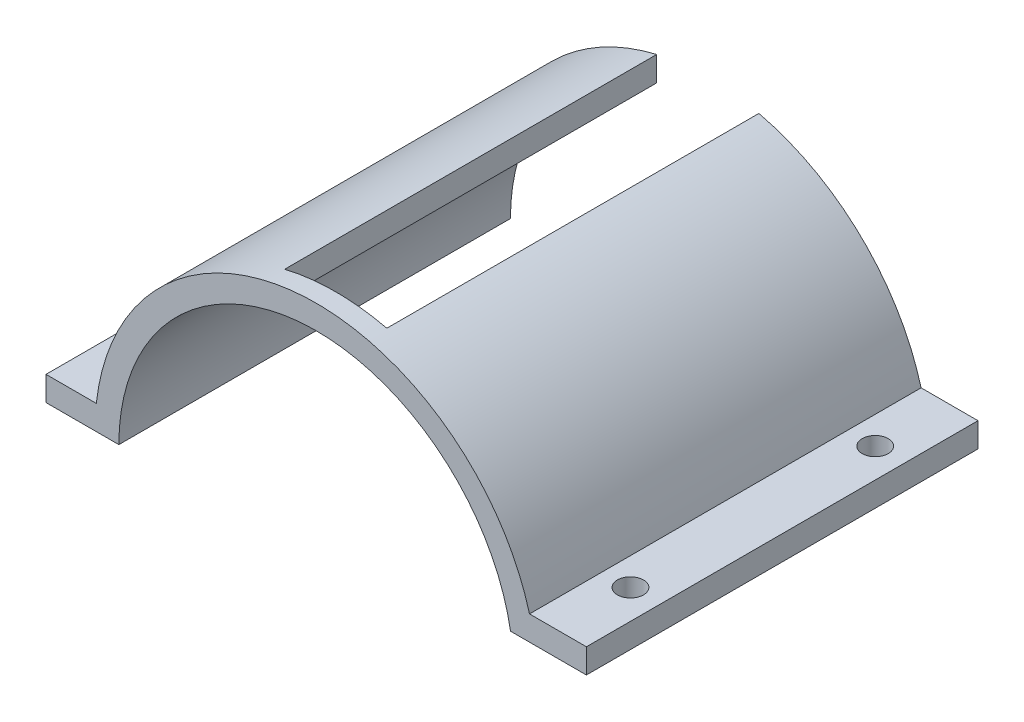
ISO-10303-21;
HEADER;
FILE_DESCRIPTION(('STEP AP214'),'2;1');
FILE_NAME('part.step','',(''),(''),'','','');
FILE_SCHEMA(('AUTOMOTIVE_DESIGN { 1 0 10303 214 1 1 1 1 }'));
ENDSEC;
DATA;
#1=APPLICATION_CONTEXT('core data for automotive mechanical design processes');
#2=APPLICATION_PROTOCOL_DEFINITION('international standard','automotive_design',2000,#1);
#3=PRODUCT_CONTEXT('',#1,'mechanical');
#4=PRODUCT('Part','Part','',(#3));
#5=PRODUCT_RELATED_PRODUCT_CATEGORY('part','',(#4));
#6=PRODUCT_DEFINITION_FORMATION('','',#4);
#7=PRODUCT_DEFINITION_CONTEXT('part definition',#1,'design');
#8=PRODUCT_DEFINITION('design','',#6,#7);
#9=PRODUCT_DEFINITION_SHAPE('','',#8);
#10=(LENGTH_UNIT() NAMED_UNIT(*) SI_UNIT(.MILLI.,.METRE.));
#11=(NAMED_UNIT(*) PLANE_ANGLE_UNIT() SI_UNIT($,.RADIAN.));
#12=(NAMED_UNIT(*) SI_UNIT($,.STERADIAN.) SOLID_ANGLE_UNIT());
#13=UNCERTAINTY_MEASURE_WITH_UNIT(LENGTH_MEASURE(1.E-05),#10,'distance_accuracy_value','');
#14=(GEOMETRIC_REPRESENTATION_CONTEXT(3) GLOBAL_UNCERTAINTY_ASSIGNED_CONTEXT((#13)) GLOBAL_UNIT_ASSIGNED_CONTEXT((#10,
#11,#12)) REPRESENTATION_CONTEXT('',''));
#15=CARTESIAN_POINT('',(0.,0.,0.));
#16=DIRECTION('',(0.,0.,1.));
#17=DIRECTION('',(1.,0.,0.));
#18=AXIS2_PLACEMENT_3D('',#15,#16,#17);
#19=CARTESIAN_POINT('',(-13.2525703735238,0.,50.8));
#20=DIRECTION('',(-1.,0.,0.));
#21=DIRECTION('',(0.,-1.,0.));
#22=AXIS2_PLACEMENT_3D('',#19,#20,#21);
#23=PLANE('',#22);
#24=DIRECTION('',(0.,0.,-1.));
#25=VECTOR('',#24,1.);
#26=CARTESIAN_POINT('',(-13.2525703735238,55.8532773836487,50.8));
#27=LINE('',#26,#25);
#28=CARTESIAN_POINT('',(-13.2525703735238,55.8532773836487,45.72));
#29=VERTEX_POINT('',#28);
#30=CARTESIAN_POINT('',(-13.2525703735238,55.8532773836487,-50.8));
#31=VERTEX_POINT('',#30);
#32=EDGE_CURVE('E11',#29,#31,#27,.T.);
#33=ORIENTED_EDGE('',*,*,#32,.F.);
#34=DIRECTION('',(0.,-1.,0.));
#35=VECTOR('',#34,1.);
#36=CARTESIAN_POINT('',(-13.2525703735238,0.,45.72));
#37=LINE('',#36,#35);
#38=CARTESIAN_POINT('',(-13.2525703735238,49.4592659648729,45.72));
#39=VERTEX_POINT('',#38);
#40=EDGE_CURVE('E173',#29,#39,#37,.T.);
#41=ORIENTED_EDGE('',*,*,#40,.T.);
#42=DIRECTION('',(0.,0.,-1.));
#43=VECTOR('',#42,1.);
#44=CARTESIAN_POINT('',(-13.2525703735238,49.4592659648729,50.8));
#45=LINE('',#44,#43);
#46=CARTESIAN_POINT('',(-13.2525703735238,49.4592659648729,-50.8));
#47=VERTEX_POINT('',#46);
#48=EDGE_CURVE('E97',#39,#47,#45,.T.);
#49=ORIENTED_EDGE('',*,*,#48,.T.);
#50=DIRECTION('',(0.,1.,0.));
#51=VECTOR('',#50,1.);
#52=CARTESIAN_POINT('',(-13.2525703735238,0.,-50.8));
#53=LINE('',#52,#51);
#54=EDGE_CURVE('E191',#47,#31,#53,.T.);
#55=ORIENTED_EDGE('',*,*,#54,.T.);
#56=EDGE_LOOP('',(#33,#41,#49,#55));
#57=FACE_BOUND('',#56,.T.);
#58=ADVANCED_FACE('F47',(#57),#23,.F.);
#59=CARTESIAN_POINT('',(0.,0.,50.8));
#60=DIRECTION('',(0.,0.,-1.));
#61=DIRECTION('',(-1.,0.,0.));
#62=AXIS2_PLACEMENT_3D('',#59,#60,#61);
#63=CYLINDRICAL_SURFACE('',#62,57.404);
#64=CARTESIAN_POINT('',(0.,0.,-50.8));
#65=DIRECTION('',(0.,0.,1.));
#66=DIRECTION('',(1.,0.,0.));
#67=AXIS2_PLACEMENT_3D('',#64,#65,#66);
#68=CIRCLE('',#67,57.404);
#69=CARTESIAN_POINT('',(-57.0517021306113,6.35,-50.8));
#70=VERTEX_POINT('',#69);
#71=EDGE_CURVE('E210',#31,#70,#68,.T.);
#72=ORIENTED_EDGE('',*,*,#71,.T.);
#73=DIRECTION('',(0.,0.,-1.));
#74=VECTOR('',#73,1.);
#75=CARTESIAN_POINT('',(-57.0517021306113,6.35,50.8));
#76=LINE('',#75,#74);
#77=CARTESIAN_POINT('',(-57.0517021306113,6.35,50.8));
#78=VERTEX_POINT('',#77);
#79=EDGE_CURVE('E55',#78,#70,#76,.T.);
#80=ORIENTED_EDGE('',*,*,#79,.F.);
#81=CARTESIAN_POINT('',(0.,0.,50.8));
#82=DIRECTION('',(0.,0.,1.));
#83=DIRECTION('',(1.,0.,0.));
#84=AXIS2_PLACEMENT_3D('',#81,#82,#83);
#85=CIRCLE('',#84,57.404);
#86=CARTESIAN_POINT('',(55.343621713371,15.2414812812697,50.8));
#87=VERTEX_POINT('',#86);
#88=EDGE_CURVE('E105',#87,#78,#85,.T.);
#89=ORIENTED_EDGE('',*,*,#88,.F.);
#90=DIRECTION('',(0.,0.,-1.));
#91=VECTOR('',#90,1.);
#92=CARTESIAN_POINT('',(55.343621713371,15.2414812812697,50.8));
#93=LINE('',#92,#91);
#94=CARTESIAN_POINT('',(55.343621713371,15.2414812812697,-50.8));
#95=VERTEX_POINT('',#94);
#96=EDGE_CURVE('E178',#87,#95,#93,.T.);
#97=ORIENTED_EDGE('',*,*,#96,.T.);
#98=CARTESIAN_POINT('',(0.,0.,-50.8));
#99=DIRECTION('',(0.,0.,1.));
#100=DIRECTION('',(1.,0.,0.));
#101=AXIS2_PLACEMENT_3D('',#98,#99,#100);
#102=CIRCLE('',#101,57.404);
#103=CARTESIAN_POINT('',(13.2525703735238,55.8532773836487,-50.8));
#104=VERTEX_POINT('',#103);
#105=EDGE_CURVE('E277',#95,#104,#102,.T.);
#106=ORIENTED_EDGE('',*,*,#105,.T.);
#107=DIRECTION('',(0.,0.,-1.));
#108=VECTOR('',#107,1.);
#109=CARTESIAN_POINT('',(13.2525703735238,55.8532773836487,50.8));
#110=LINE('',#109,#108);
#111=CARTESIAN_POINT('',(13.2525703735238,55.8532773836487,45.72));
#112=VERTEX_POINT('',#111);
#113=EDGE_CURVE('E264',#112,#104,#110,.T.);
#114=ORIENTED_EDGE('',*,*,#113,.F.);
#115=CARTESIAN_POINT('',(0.,0.,45.72));
#116=DIRECTION('',(0.,0.,1.));
#117=DIRECTION('',(1.,0.,0.));
#118=AXIS2_PLACEMENT_3D('',#115,#116,#117);
#119=CIRCLE('',#118,57.404);
#120=EDGE_CURVE('E187',#112,#29,#119,.T.);
#121=ORIENTED_EDGE('',*,*,#120,.T.);
#122=ORIENTED_EDGE('',*,*,#32,.T.);
#123=EDGE_LOOP('',(#72,#80,#89,#97,#106,#114,#121,#122));
#124=FACE_BOUND('',#123,.T.);
#125=ADVANCED_FACE('F244',(#124),#63,.T.);
#126=CARTESIAN_POINT('',(0.,6.35,50.8));
#127=DIRECTION('',(0.,1.,0.));
#128=DIRECTION('',(-1.,0.,0.));
#129=AXIS2_PLACEMENT_3D('',#126,#127,#128);
#130=PLANE('',#129);
#131=CARTESIAN_POINT('',(-62.484,6.35,-31.75));
#132=DIRECTION('',(0.,1.,0.));
#133=DIRECTION('',(0.,0.,1.));
#134=AXIS2_PLACEMENT_3D('',#131,#132,#133);
#135=CIRCLE('',#134,3.3782);
#136=CARTESIAN_POINT('',(-62.484,6.35,-28.3718));
#137=VERTEX_POINT('',#136);
#138=EDGE_CURVE('E309',#137,#137,#135,.T.);
#139=ORIENTED_EDGE('',*,*,#138,.F.);
#140=EDGE_LOOP('',(#139));
#141=FACE_BOUND('',#140,.T.);
#142=CARTESIAN_POINT('',(-62.484,6.35,31.75));
#143=DIRECTION('',(0.,1.,0.));
#144=DIRECTION('',(0.,0.,1.));
#145=AXIS2_PLACEMENT_3D('',#142,#143,#144);
#146=CIRCLE('',#145,3.3782);
#147=CARTESIAN_POINT('',(-62.484,6.35,35.1282));
#148=VERTEX_POINT('',#147);
#149=EDGE_CURVE('E301',#148,#148,#146,.T.);
#150=ORIENTED_EDGE('',*,*,#149,.F.);
#151=EDGE_LOOP('',(#150));
#152=FACE_BOUND('',#151,.T.);
#153=DIRECTION('',(1.,0.,0.));
#154=VECTOR('',#153,1.);
#155=CARTESIAN_POINT('',(0.,6.35,-50.8));
#156=LINE('',#155,#154);
#157=CARTESIAN_POINT('',(-70.104,6.35,-50.8));
#158=VERTEX_POINT('',#157);
#159=EDGE_CURVE('E214',#158,#70,#156,.T.);
#160=ORIENTED_EDGE('',*,*,#159,.F.);
#161=DIRECTION('',(0.,0.,-1.));
#162=VECTOR('',#161,1.);
#163=CARTESIAN_POINT('',(-70.104,6.35,50.8));
#164=LINE('',#163,#162);
#165=CARTESIAN_POINT('',(-70.104,6.35,50.8));
#166=VERTEX_POINT('',#165);
#167=EDGE_CURVE('E236',#166,#158,#164,.T.);
#168=ORIENTED_EDGE('',*,*,#167,.F.);
#169=DIRECTION('',(1.,0.,0.));
#170=VECTOR('',#169,1.);
#171=CARTESIAN_POINT('',(0.,6.35,50.8));
#172=LINE('',#171,#170);
#173=EDGE_CURVE('E194',#166,#78,#172,.T.);
#174=ORIENTED_EDGE('',*,*,#173,.T.);
#175=ORIENTED_EDGE('',*,*,#79,.T.);
#176=EDGE_LOOP('',(#160,#168,#174,#175));
#177=FACE_BOUND('',#176,.T.);
#178=ADVANCED_FACE('F241',(#141,#152,#177),#130,.T.);
#179=CARTESIAN_POINT('',(-70.104,0.,50.8));
#180=DIRECTION('',(-1.,0.,0.));
#181=DIRECTION('',(0.,0.,1.));
#182=AXIS2_PLACEMENT_3D('',#179,#180,#181);
#183=PLANE('',#182);
#184=DIRECTION('',(0.,1.,0.));
#185=VECTOR('',#184,1.);
#186=CARTESIAN_POINT('',(-70.104,0.,-50.8));
#187=LINE('',#186,#185);
#188=CARTESIAN_POINT('',(-70.104,0.,-50.8));
#189=VERTEX_POINT('',#188);
#190=EDGE_CURVE('E218',#189,#158,#187,.T.);
#191=ORIENTED_EDGE('',*,*,#190,.F.);
#192=DIRECTION('',(0.,0.,-1.));
#193=VECTOR('',#192,1.);
#194=CARTESIAN_POINT('',(-70.104,0.,50.8));
#195=LINE('',#194,#193);
#196=CARTESIAN_POINT('',(-70.104,0.,50.8));
#197=VERTEX_POINT('',#196);
#198=EDGE_CURVE('E233',#197,#189,#195,.T.);
#199=ORIENTED_EDGE('',*,*,#198,.F.);
#200=DIRECTION('',(0.,1.,0.));
#201=VECTOR('',#200,1.);
#202=CARTESIAN_POINT('',(-70.104,0.,50.8));
#203=LINE('',#202,#201);
#204=EDGE_CURVE('E199',#197,#166,#203,.T.);
#205=ORIENTED_EDGE('',*,*,#204,.T.);
#206=ORIENTED_EDGE('',*,*,#167,.T.);
#207=EDGE_LOOP('',(#191,#199,#205,#206));
#208=FACE_BOUND('',#207,.T.);
#209=ADVANCED_FACE('F250',(#208),#183,.T.);
#210=CARTESIAN_POINT('',(0.,0.,50.8));
#211=DIRECTION('',(0.,-1.,0.));
#212=DIRECTION('',(1.,0.,0.));
#213=AXIS2_PLACEMENT_3D('',#210,#211,#212);
#214=PLANE('',#213);
#215=CARTESIAN_POINT('',(-62.484,0.,-31.75));
#216=DIRECTION('',(0.,1.,0.));
#217=DIRECTION('',(0.,0.,1.));
#218=AXIS2_PLACEMENT_3D('',#215,#216,#217);
#219=CIRCLE('',#218,3.3782);
#220=CARTESIAN_POINT('',(-62.484,0.,-28.3718));
#221=VERTEX_POINT('',#220);
#222=EDGE_CURVE('E305',#221,#221,#219,.T.);
#223=ORIENTED_EDGE('',*,*,#222,.T.);
#224=EDGE_LOOP('',(#223));
#225=FACE_BOUND('',#224,.T.);
#226=CARTESIAN_POINT('',(-62.484,0.,31.75));
#227=DIRECTION('',(0.,1.,0.));
#228=DIRECTION('',(0.,0.,1.));
#229=AXIS2_PLACEMENT_3D('',#226,#227,#228);
#230=CIRCLE('',#229,3.3782);
#231=CARTESIAN_POINT('',(-62.484,0.,35.1282));
#232=VERTEX_POINT('',#231);
#233=EDGE_CURVE('E296',#232,#232,#230,.T.);
#234=ORIENTED_EDGE('',*,*,#233,.T.);
#235=EDGE_LOOP('',(#234));
#236=FACE_BOUND('',#235,.T.);
#237=DIRECTION('',(-1.,0.,0.));
#238=VECTOR('',#237,1.);
#239=CARTESIAN_POINT('',(0.,0.,-50.8));
#240=LINE('',#239,#238);
#241=CARTESIAN_POINT('',(-51.203999954,0.,-50.8));
#242=VERTEX_POINT('',#241);
#243=EDGE_CURVE('E222',#242,#189,#240,.T.);
#244=ORIENTED_EDGE('',*,*,#243,.F.);
#245=DIRECTION('',(0.,0.,-1.));
#246=VECTOR('',#245,1.);
#247=CARTESIAN_POINT('',(-51.203999954,0.,50.8));
#248=LINE('',#247,#246);
#249=CARTESIAN_POINT('',(-51.203999954,0.,50.8));
#250=VERTEX_POINT('',#249);
#251=EDGE_CURVE('E71',#250,#242,#248,.T.);
#252=ORIENTED_EDGE('',*,*,#251,.F.);
#253=DIRECTION('',(-1.,0.,0.));
#254=VECTOR('',#253,1.);
#255=CARTESIAN_POINT('',(0.,0.,50.8));
#256=LINE('',#255,#254);
#257=EDGE_CURVE('E203',#250,#197,#256,.T.);
#258=ORIENTED_EDGE('',*,*,#257,.T.);
#259=ORIENTED_EDGE('',*,*,#198,.T.);
#260=EDGE_LOOP('',(#244,#252,#258,#259));
#261=FACE_BOUND('',#260,.T.);
#262=ADVANCED_FACE('F252',(#225,#236,#261),#214,.T.);
#263=CARTESIAN_POINT('',(0.,0.,50.8));
#264=DIRECTION('',(0.,0.,-1.));
#265=DIRECTION('',(-1.,0.,0.));
#266=AXIS2_PLACEMENT_3D('',#263,#264,#265);
#267=CYLINDRICAL_SURFACE('',#266,51.203999954);
#268=CARTESIAN_POINT('',(0.,0.,-50.8));
#269=DIRECTION('',(0.,0.,1.));
#270=DIRECTION('',(1.,0.,0.));
#271=AXIS2_PLACEMENT_3D('',#268,#269,#270);
#272=CIRCLE('',#271,51.203999954);
#273=EDGE_CURVE('E195',#47,#242,#272,.T.);
#274=ORIENTED_EDGE('',*,*,#273,.F.);
#275=ORIENTED_EDGE('',*,*,#48,.F.);
#276=CARTESIAN_POINT('',(0.,0.,45.72));
#277=DIRECTION('',(0.,0.,1.));
#278=DIRECTION('',(1.,0.,0.));
#279=AXIS2_PLACEMENT_3D('',#276,#277,#278);
#280=CIRCLE('',#279,51.203999954);
#281=CARTESIAN_POINT('',(13.2525703735238,49.4592659648728,45.72));
#282=VERTEX_POINT('',#281);
#283=EDGE_CURVE('E62',#282,#39,#280,.T.);
#284=ORIENTED_EDGE('',*,*,#283,.F.);
#285=DIRECTION('',(0.,0.,-1.));
#286=VECTOR('',#285,1.);
#287=CARTESIAN_POINT('',(13.2525703735238,49.4592659648729,50.8));
#288=LINE('',#287,#286);
#289=CARTESIAN_POINT('',(13.2525703735238,49.4592659648729,-50.8));
#290=VERTEX_POINT('',#289);
#291=EDGE_CURVE('E260',#282,#290,#288,.T.);
#292=ORIENTED_EDGE('',*,*,#291,.T.);
#293=CARTESIAN_POINT('',(0.,0.,-50.8));
#294=DIRECTION('',(0.,0.,1.));
#295=DIRECTION('',(1.,0.,0.));
#296=AXIS2_PLACEMENT_3D('',#293,#294,#295);
#297=CIRCLE('',#296,51.203999954);
#298=CARTESIAN_POINT('',(50.426096139936,8.8914812812697,-50.8));
#299=VERTEX_POINT('',#298);
#300=EDGE_CURVE('E167',#299,#290,#297,.T.);
#301=ORIENTED_EDGE('',*,*,#300,.F.);
#302=DIRECTION('',(0.,0.,-1.));
#303=VECTOR('',#302,1.);
#304=CARTESIAN_POINT('',(50.426096139936,8.8914812812697,50.8));
#305=LINE('',#304,#303);
#306=CARTESIAN_POINT('',(50.426096139936,8.8914812812697,50.8));
#307=VERTEX_POINT('',#306);
#308=EDGE_CURVE('E257',#307,#299,#305,.T.);
#309=ORIENTED_EDGE('',*,*,#308,.F.);
#310=CARTESIAN_POINT('',(0.,0.,50.8));
#311=DIRECTION('',(0.,0.,1.));
#312=DIRECTION('',(1.,0.,0.));
#313=AXIS2_PLACEMENT_3D('',#310,#311,#312);
#314=CIRCLE('',#313,51.203999954);
#315=EDGE_CURVE('E163',#307,#250,#314,.T.);
#316=ORIENTED_EDGE('',*,*,#315,.T.);
#317=ORIENTED_EDGE('',*,*,#251,.T.);
#318=EDGE_LOOP('',(#274,#275,#284,#292,#301,#309,#316,#317));
#319=FACE_BOUND('',#318,.T.);
#320=ADVANCED_FACE('F255',(#319),#267,.F.);
#321=CARTESIAN_POINT('',(0.,0.,50.8));
#322=DIRECTION('',(0.,0.,1.));
#323=DIRECTION('',(1.,0.,0.));
#324=AXIS2_PLACEMENT_3D('',#321,#322,#323);
#325=PLANE('',#324);
#326=ORIENTED_EDGE('',*,*,#315,.F.);
#327=DIRECTION('',(1.,0.,0.));
#328=VECTOR('',#327,1.);
#329=CARTESIAN_POINT('',(0.,8.8914812812697,50.8));
#330=LINE('',#329,#328);
#331=CARTESIAN_POINT('',(70.104,8.8914812812697,50.8));
#332=VERTEX_POINT('',#331);
#333=EDGE_CURVE('E158',#307,#332,#330,.T.);
#334=ORIENTED_EDGE('',*,*,#333,.T.);
#335=DIRECTION('',(0.,1.,0.));
#336=VECTOR('',#335,1.);
#337=CARTESIAN_POINT('',(70.104,0.,50.8));
#338=LINE('',#337,#336);
#339=CARTESIAN_POINT('',(70.104,15.2414812812697,50.8));
#340=VERTEX_POINT('',#339);
#341=EDGE_CURVE('E147',#332,#340,#338,.T.);
#342=ORIENTED_EDGE('',*,*,#341,.T.);
#343=DIRECTION('',(-1.,0.,0.));
#344=VECTOR('',#343,1.);
#345=CARTESIAN_POINT('',(0.,15.2414812812697,50.8));
#346=LINE('',#345,#344);
#347=EDGE_CURVE('E157',#340,#87,#346,.T.);
#348=ORIENTED_EDGE('',*,*,#347,.T.);
#349=ORIENTED_EDGE('',*,*,#88,.T.);
#350=ORIENTED_EDGE('',*,*,#173,.F.);
#351=ORIENTED_EDGE('',*,*,#204,.F.);
#352=ORIENTED_EDGE('',*,*,#257,.F.);
#353=EDGE_LOOP('',(#326,#334,#342,#348,#349,#350,#351,#352));
#354=FACE_BOUND('',#353,.T.);
#355=ADVANCED_FACE('F161',(#354),#325,.T.);
#356=CARTESIAN_POINT('',(0.,0.,-50.8));
#357=DIRECTION('',(0.,0.,1.));
#358=DIRECTION('',(1.,0.,0.));
#359=AXIS2_PLACEMENT_3D('',#356,#357,#358);
#360=PLANE('',#359);
#361=ORIENTED_EDGE('',*,*,#54,.F.);
#362=ORIENTED_EDGE('',*,*,#273,.T.);
#363=ORIENTED_EDGE('',*,*,#243,.T.);
#364=ORIENTED_EDGE('',*,*,#190,.T.);
#365=ORIENTED_EDGE('',*,*,#159,.T.);
#366=ORIENTED_EDGE('',*,*,#71,.F.);
#367=EDGE_LOOP('',(#361,#362,#363,#364,#365,#366));
#368=FACE_BOUND('',#367,.T.);
#369=ADVANCED_FACE('F247',(#368),#360,.F.);
#370=CARTESIAN_POINT('',(0.,0.,45.72));
#371=DIRECTION('',(0.,0.,1.));
#372=DIRECTION('',(1.,0.,0.));
#373=AXIS2_PLACEMENT_3D('',#370,#371,#372);
#374=PLANE('',#373);
#375=ORIENTED_EDGE('',*,*,#40,.F.);
#376=ORIENTED_EDGE('',*,*,#120,.F.);
#377=DIRECTION('',(0.,-1.,0.));
#378=VECTOR('',#377,1.);
#379=CARTESIAN_POINT('',(13.2525703735238,0.,45.72));
#380=LINE('',#379,#378);
#381=EDGE_CURVE('E184',#112,#282,#380,.T.);
#382=ORIENTED_EDGE('',*,*,#381,.T.);
#383=ORIENTED_EDGE('',*,*,#283,.T.);
#384=EDGE_LOOP('',(#375,#376,#382,#383));
#385=FACE_BOUND('',#384,.T.);
#386=ADVANCED_FACE('F356',(#385),#374,.F.);
#387=CARTESIAN_POINT('',(13.2525703735238,0.,50.8));
#388=DIRECTION('',(-1.,0.,0.));
#389=DIRECTION('',(0.,0.,1.));
#390=AXIS2_PLACEMENT_3D('',#387,#388,#389);
#391=PLANE('',#390);
#392=ORIENTED_EDGE('',*,*,#381,.F.);
#393=ORIENTED_EDGE('',*,*,#113,.T.);
#394=DIRECTION('',(0.,1.,0.));
#395=VECTOR('',#394,1.);
#396=CARTESIAN_POINT('',(13.2525703735238,0.,-50.8));
#397=LINE('',#396,#395);
#398=EDGE_CURVE('E285',#290,#104,#397,.T.);
#399=ORIENTED_EDGE('',*,*,#398,.F.);
#400=ORIENTED_EDGE('',*,*,#291,.F.);
#401=EDGE_LOOP('',(#392,#393,#399,#400));
#402=FACE_BOUND('',#401,.T.);
#403=ADVANCED_FACE('F347',(#402),#391,.T.);
#404=CARTESIAN_POINT('',(0.,8.8914812812697,50.8));
#405=DIRECTION('',(0.,1.,0.));
#406=DIRECTION('',(0.,0.,1.));
#407=AXIS2_PLACEMENT_3D('',#404,#405,#406);
#408=PLANE('',#407);
#409=CARTESIAN_POINT('',(62.484,8.8914812812697,-31.75));
#410=DIRECTION('',(0.,1.,0.));
#411=DIRECTION('',(0.,0.,1.));
#412=AXIS2_PLACEMENT_3D('',#409,#410,#411);
#413=CIRCLE('',#412,3.3782);
#414=CARTESIAN_POINT('',(62.484,8.8914812812697,-28.3718));
#415=VERTEX_POINT('',#414);
#416=EDGE_CURVE('E321',#415,#415,#413,.T.);
#417=ORIENTED_EDGE('',*,*,#416,.T.);
#418=EDGE_LOOP('',(#417));
#419=FACE_BOUND('',#418,.T.);
#420=CARTESIAN_POINT('',(62.484,8.8914812812697,31.75));
#421=DIRECTION('',(0.,1.,0.));
#422=DIRECTION('',(0.,0.,1.));
#423=AXIS2_PLACEMENT_3D('',#420,#421,#422);
#424=CIRCLE('',#423,3.3782);
#425=CARTESIAN_POINT('',(62.484,8.8914812812697,35.1282));
#426=VERTEX_POINT('',#425);
#427=EDGE_CURVE('E313',#426,#426,#424,.T.);
#428=ORIENTED_EDGE('',*,*,#427,.T.);
#429=EDGE_LOOP('',(#428));
#430=FACE_BOUND('',#429,.T.);
#431=DIRECTION('',(1.,0.,0.));
#432=VECTOR('',#431,1.);
#433=CARTESIAN_POINT('',(0.,8.8914812812697,-50.8));
#434=LINE('',#433,#432);
#435=CARTESIAN_POINT('',(70.104,8.8914812812697,-50.8));
#436=VERTEX_POINT('',#435);
#437=EDGE_CURVE('E171',#299,#436,#434,.T.);
#438=ORIENTED_EDGE('',*,*,#437,.T.);
#439=DIRECTION('',(0.,0.,-1.));
#440=VECTOR('',#439,1.);
#441=CARTESIAN_POINT('',(70.104,8.8914812812697,50.8));
#442=LINE('',#441,#440);
#443=EDGE_CURVE('E151',#332,#436,#442,.T.);
#444=ORIENTED_EDGE('',*,*,#443,.F.);
#445=ORIENTED_EDGE('',*,*,#333,.F.);
#446=ORIENTED_EDGE('',*,*,#308,.T.);
#447=EDGE_LOOP('',(#438,#444,#445,#446));
#448=FACE_BOUND('',#447,.T.);
#449=ADVANCED_FACE('F169',(#419,#430,#448),#408,.F.);
#450=CARTESIAN_POINT('',(70.104,0.,50.8));
#451=DIRECTION('',(-1.,0.,0.));
#452=DIRECTION('',(0.,0.,1.));
#453=AXIS2_PLACEMENT_3D('',#450,#451,#452);
#454=PLANE('',#453);
#455=DIRECTION('',(0.,1.,0.));
#456=VECTOR('',#455,1.);
#457=CARTESIAN_POINT('',(70.104,0.,-50.8));
#458=LINE('',#457,#456);
#459=CARTESIAN_POINT('',(70.104,15.2414812812697,-50.8));
#460=VERTEX_POINT('',#459);
#461=EDGE_CURVE('E290',#436,#460,#458,.T.);
#462=ORIENTED_EDGE('',*,*,#461,.T.);
#463=DIRECTION('',(0.,0.,-1.));
#464=VECTOR('',#463,1.);
#465=CARTESIAN_POINT('',(70.104,15.2414812812697,50.8));
#466=LINE('',#465,#464);
#467=EDGE_CURVE('E154',#340,#460,#466,.T.);
#468=ORIENTED_EDGE('',*,*,#467,.F.);
#469=ORIENTED_EDGE('',*,*,#341,.F.);
#470=ORIENTED_EDGE('',*,*,#443,.T.);
#471=EDGE_LOOP('',(#462,#468,#469,#470));
#472=FACE_BOUND('',#471,.T.);
#473=ADVANCED_FACE('F149',(#472),#454,.F.);
#474=CARTESIAN_POINT('',(0.,15.2414812812697,50.8));
#475=DIRECTION('',(0.,-1.,0.));
#476=DIRECTION('',(1.,0.,0.));
#477=AXIS2_PLACEMENT_3D('',#474,#475,#476);
#478=PLANE('',#477);
#479=CARTESIAN_POINT('',(62.484,15.2414812812697,-31.75));
#480=DIRECTION('',(0.,1.,0.));
#481=DIRECTION('',(0.,0.,1.));
#482=AXIS2_PLACEMENT_3D('',#479,#480,#481);
#483=CIRCLE('',#482,3.3782);
#484=CARTESIAN_POINT('',(62.484,15.2414812812697,-28.3718));
#485=VERTEX_POINT('',#484);
#486=EDGE_CURVE('E325',#485,#485,#483,.T.);
#487=ORIENTED_EDGE('',*,*,#486,.F.);
#488=EDGE_LOOP('',(#487));
#489=FACE_BOUND('',#488,.T.);
#490=CARTESIAN_POINT('',(62.484,15.2414812812697,31.75));
#491=DIRECTION('',(0.,1.,0.));
#492=DIRECTION('',(0.,0.,1.));
#493=AXIS2_PLACEMENT_3D('',#490,#491,#492);
#494=CIRCLE('',#493,3.3782);
#495=CARTESIAN_POINT('',(62.484,15.2414812812697,35.1282));
#496=VERTEX_POINT('',#495);
#497=EDGE_CURVE('E317',#496,#496,#494,.T.);
#498=ORIENTED_EDGE('',*,*,#497,.F.);
#499=EDGE_LOOP('',(#498));
#500=FACE_BOUND('',#499,.T.);
#501=DIRECTION('',(-1.,0.,0.));
#502=VECTOR('',#501,1.);
#503=CARTESIAN_POINT('',(0.,15.2414812812697,-50.8));
#504=LINE('',#503,#502);
#505=EDGE_CURVE('E283',#460,#95,#504,.T.);
#506=ORIENTED_EDGE('',*,*,#505,.T.);
#507=ORIENTED_EDGE('',*,*,#96,.F.);
#508=ORIENTED_EDGE('',*,*,#347,.F.);
#509=ORIENTED_EDGE('',*,*,#467,.T.);
#510=EDGE_LOOP('',(#506,#507,#508,#509));
#511=FACE_BOUND('',#510,.T.);
#512=ADVANCED_FACE('F333',(#489,#500,#511),#478,.F.);
#513=CARTESIAN_POINT('',(0.,0.,-50.8));
#514=DIRECTION('',(0.,0.,1.));
#515=DIRECTION('',(1.,0.,0.));
#516=AXIS2_PLACEMENT_3D('',#513,#514,#515);
#517=PLANE('',#516);
#518=ORIENTED_EDGE('',*,*,#437,.F.);
#519=ORIENTED_EDGE('',*,*,#300,.T.);
#520=ORIENTED_EDGE('',*,*,#398,.T.);
#521=ORIENTED_EDGE('',*,*,#105,.F.);
#522=ORIENTED_EDGE('',*,*,#505,.F.);
#523=ORIENTED_EDGE('',*,*,#461,.F.);
#524=EDGE_LOOP('',(#518,#519,#520,#521,#522,#523));
#525=FACE_BOUND('',#524,.T.);
#526=ADVANCED_FACE('F282',(#525),#517,.F.);
#527=CARTESIAN_POINT('',(-62.484,6.35,31.75));
#528=DIRECTION('',(0.,1.,0.));
#529=DIRECTION('',(0.,0.,1.));
#530=AXIS2_PLACEMENT_3D('',#527,#528,#529);
#531=CYLINDRICAL_SURFACE('',#530,3.3782);
#532=ORIENTED_EDGE('',*,*,#233,.F.);
#533=EDGE_LOOP('',(#532));
#534=FACE_BOUND('',#533,.T.);
#535=ORIENTED_EDGE('',*,*,#149,.T.);
#536=EDGE_LOOP('',(#535));
#537=FACE_BOUND('',#536,.T.);
#538=ADVANCED_FACE('F390',(#534,#537),#531,.F.);
#539=CARTESIAN_POINT('',(-62.484,6.35,-31.75));
#540=DIRECTION('',(0.,1.,0.));
#541=DIRECTION('',(0.,0.,1.));
#542=AXIS2_PLACEMENT_3D('',#539,#540,#541);
#543=CYLINDRICAL_SURFACE('',#542,3.3782);
#544=ORIENTED_EDGE('',*,*,#222,.F.);
#545=EDGE_LOOP('',(#544));
#546=FACE_BOUND('',#545,.T.);
#547=ORIENTED_EDGE('',*,*,#138,.T.);
#548=EDGE_LOOP('',(#547));
#549=FACE_BOUND('',#548,.T.);
#550=ADVANCED_FACE('F342',(#546,#549),#543,.F.);
#551=CARTESIAN_POINT('',(62.484,15.2414812812697,31.75));
#552=DIRECTION('',(0.,1.,0.));
#553=DIRECTION('',(0.,0.,1.));
#554=AXIS2_PLACEMENT_3D('',#551,#552,#553);
#555=CYLINDRICAL_SURFACE('',#554,3.3782);
#556=ORIENTED_EDGE('',*,*,#497,.T.);
#557=EDGE_LOOP('',(#556));
#558=FACE_BOUND('',#557,.T.);
#559=ORIENTED_EDGE('',*,*,#427,.F.);
#560=EDGE_LOOP('',(#559));
#561=FACE_BOUND('',#560,.T.);
#562=ADVANCED_FACE('F339',(#558,#561),#555,.F.);
#563=CARTESIAN_POINT('',(62.484,15.2414812812697,-31.75));
#564=DIRECTION('',(0.,1.,0.));
#565=DIRECTION('',(0.,0.,1.));
#566=AXIS2_PLACEMENT_3D('',#563,#564,#565);
#567=CYLINDRICAL_SURFACE('',#566,3.3782);
#568=ORIENTED_EDGE('',*,*,#486,.T.);
#569=EDGE_LOOP('',(#568));
#570=FACE_BOUND('',#569,.T.);
#571=ORIENTED_EDGE('',*,*,#416,.F.);
#572=EDGE_LOOP('',(#571));
#573=FACE_BOUND('',#572,.T.);
#574=ADVANCED_FACE('F330',(#570,#573),#567,.F.);
#575=CLOSED_SHELL('',(#58,#125,#178,#209,#262,#320,#355,#369,#386,#403,#449,#473,#512,#526,#538,
#550,#562,#574));
#576=MANIFOLD_SOLID_BREP('B2',#575);
#577=ADVANCED_BREP_SHAPE_REPRESENTATION('',(#18,#576),#14);
#578=SHAPE_DEFINITION_REPRESENTATION(#9,#577);
ENDSEC;
END-ISO-10303-21;
